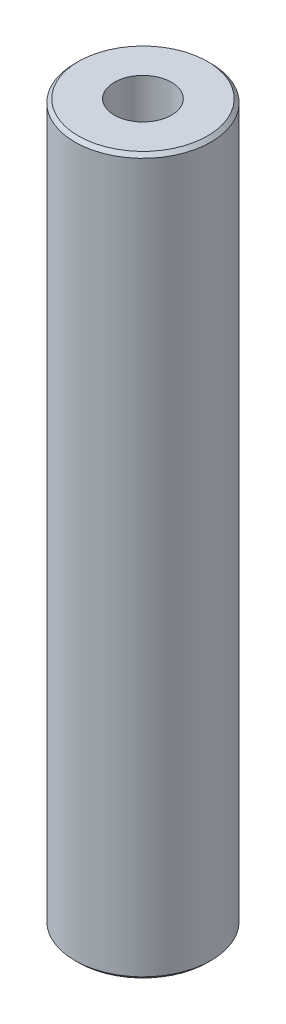
ISO-10303-21;
HEADER;
FILE_DESCRIPTION(('STEP AP214'),'2;1');
FILE_NAME('part.step','',(''),(''),'','','');
FILE_SCHEMA(('AUTOMOTIVE_DESIGN { 1 0 10303 214 1 1 1 1 }'));
ENDSEC;
DATA;
#1=APPLICATION_CONTEXT('core data for automotive mechanical design processes');
#2=APPLICATION_PROTOCOL_DEFINITION('international standard','automotive_design',2000,#1);
#3=PRODUCT_CONTEXT('',#1,'mechanical');
#4=PRODUCT('Part','Part','',(#3));
#5=PRODUCT_RELATED_PRODUCT_CATEGORY('part','',(#4));
#6=PRODUCT_DEFINITION_FORMATION('','',#4);
#7=PRODUCT_DEFINITION_CONTEXT('part definition',#1,'design');
#8=PRODUCT_DEFINITION('design','',#6,#7);
#9=PRODUCT_DEFINITION_SHAPE('','',#8);
#10=(LENGTH_UNIT() NAMED_UNIT(*) SI_UNIT(.MILLI.,.METRE.));
#11=(NAMED_UNIT(*) PLANE_ANGLE_UNIT() SI_UNIT($,.RADIAN.));
#12=(NAMED_UNIT(*) SI_UNIT($,.STERADIAN.) SOLID_ANGLE_UNIT());
#13=UNCERTAINTY_MEASURE_WITH_UNIT(LENGTH_MEASURE(1.E-05),#10,'distance_accuracy_value','');
#14=(GEOMETRIC_REPRESENTATION_CONTEXT(3) GLOBAL_UNCERTAINTY_ASSIGNED_CONTEXT((#13)) GLOBAL_UNIT_ASSIGNED_CONTEXT((#10,
#11,#12)) REPRESENTATION_CONTEXT('',''));
#15=CARTESIAN_POINT('',(0.,0.,0.));
#16=DIRECTION('',(0.,0.,1.));
#17=DIRECTION('',(1.,0.,0.));
#18=AXIS2_PLACEMENT_3D('',#15,#16,#17);
#19=CARTESIAN_POINT('',(0.,157.746344230071,0.));
#20=DIRECTION('',(0.,-1.,0.));
#21=DIRECTION('',(0.,0.,-1.));
#22=AXIS2_PLACEMENT_3D('',#19,#20,#21);
#23=CYLINDRICAL_SURFACE('',#22,15.);
#24=CARTESIAN_POINT('',(0.,156.971094666911,0.));
#25=DIRECTION('',(0.,1.,0.));
#26=DIRECTION('',(0.,0.,1.));
#27=AXIS2_PLACEMENT_3D('',#24,#25,#26);
#28=CIRCLE('',#27,15.);
#29=CARTESIAN_POINT('',(0.,156.971094666911,15.));
#30=VERTEX_POINT('',#29);
#31=EDGE_CURVE('E50',#30,#30,#28,.F.);
#32=ORIENTED_EDGE('',*,*,#31,.T.);
#33=EDGE_LOOP('',(#32));
#34=FACE_BOUND('',#33,.T.);
#35=CARTESIAN_POINT('',(0.,0.775249563159858,0.));
#36=DIRECTION('',(0.,1.,0.));
#37=DIRECTION('',(0.,0.,1.));
#38=AXIS2_PLACEMENT_3D('',#35,#36,#37);
#39=CIRCLE('',#38,15.);
#40=CARTESIAN_POINT('',(0.,0.775249563159858,15.));
#41=VERTEX_POINT('',#40);
#42=EDGE_CURVE('E51',#41,#41,#39,.T.);
#43=ORIENTED_EDGE('',*,*,#42,.T.);
#44=EDGE_LOOP('',(#43));
#45=FACE_BOUND('',#44,.T.);
#46=ADVANCED_FACE('F39',(#34,#45),#23,.T.);
#47=CARTESIAN_POINT('',(0.,157.746344230071,0.));
#48=DIRECTION('',(0.,1.,0.));
#49=DIRECTION('',(0.,0.,1.));
#50=AXIS2_PLACEMENT_3D('',#47,#48,#49);
#51=PLANE('',#50);
#52=CARTESIAN_POINT('',(0.,157.746344230071,0.));
#53=DIRECTION('',(0.,1.,0.));
#54=DIRECTION('',(0.,0.,1.));
#55=AXIS2_PLACEMENT_3D('',#52,#53,#54);
#56=CIRCLE('',#55,14.2247504368402);
#57=CARTESIAN_POINT('',(0.,157.746344230071,14.2247504368402));
#58=VERTEX_POINT('',#57);
#59=EDGE_CURVE('E54',#58,#58,#56,.T.);
#60=ORIENTED_EDGE('',*,*,#59,.T.);
#61=EDGE_LOOP('',(#60));
#62=FACE_BOUND('',#61,.T.);
#63=CARTESIAN_POINT('',(0.,157.746344230071,0.));
#64=DIRECTION('',(0.,1.,0.));
#65=DIRECTION('',(0.,0.,1.));
#66=AXIS2_PLACEMENT_3D('',#63,#64,#65);
#67=CIRCLE('',#66,6.29299490322832);
#68=CARTESIAN_POINT('',(0.,157.746344230071,6.29299490322832));
#69=VERTEX_POINT('',#68);
#70=EDGE_CURVE('E58',#69,#69,#67,.T.);
#71=ORIENTED_EDGE('',*,*,#70,.F.);
#72=EDGE_LOOP('',(#71));
#73=FACE_BOUND('',#72,.T.);
#74=ADVANCED_FACE('F69',(#62,#73),#51,.T.);
#75=CARTESIAN_POINT('',(0.,0.,0.));
#76=DIRECTION('',(0.,1.,0.));
#77=DIRECTION('',(0.,0.,1.));
#78=AXIS2_PLACEMENT_3D('',#75,#76,#77);
#79=PLANE('',#78);
#80=CARTESIAN_POINT('',(0.,0.,0.));
#81=DIRECTION('',(0.,1.,0.));
#82=DIRECTION('',(0.,0.,1.));
#83=AXIS2_PLACEMENT_3D('',#80,#81,#82);
#84=CIRCLE('',#83,14.2247504368401);
#85=CARTESIAN_POINT('',(0.,0.,14.2247504368401));
#86=VERTEX_POINT('',#85);
#87=EDGE_CURVE('E10',#86,#86,#84,.F.);
#88=ORIENTED_EDGE('',*,*,#87,.T.);
#89=EDGE_LOOP('',(#88));
#90=FACE_BOUND('',#89,.T.);
#91=CARTESIAN_POINT('',(0.,0.,0.));
#92=DIRECTION('',(0.,1.,0.));
#93=DIRECTION('',(0.,0.,1.));
#94=AXIS2_PLACEMENT_3D('',#91,#92,#93);
#95=CIRCLE('',#94,6.29299490322832);
#96=CARTESIAN_POINT('',(0.,0.,6.29299490322832));
#97=VERTEX_POINT('',#96);
#98=EDGE_CURVE('E63',#97,#97,#95,.T.);
#99=ORIENTED_EDGE('',*,*,#98,.T.);
#100=EDGE_LOOP('',(#99));
#101=FACE_BOUND('',#100,.T.);
#102=ADVANCED_FACE('F75',(#90,#101),#79,.F.);
#103=CARTESIAN_POINT('',(0.,157.746344230071,0.));
#104=DIRECTION('',(0.,-1.,0.));
#105=DIRECTION('',(0.,0.,-1.));
#106=AXIS2_PLACEMENT_3D('',#103,#104,#105);
#107=CYLINDRICAL_SURFACE('',#106,6.29299490322832);
#108=ORIENTED_EDGE('',*,*,#70,.T.);
#109=EDGE_LOOP('',(#108));
#110=FACE_BOUND('',#109,.T.);
#111=ORIENTED_EDGE('',*,*,#98,.F.);
#112=EDGE_LOOP('',(#111));
#113=FACE_BOUND('',#112,.T.);
#114=ADVANCED_FACE('F70',(#110,#113),#107,.F.);
#115=CARTESIAN_POINT('',(0.,157.746344230071,0.));
#116=DIRECTION('',(0.,-1.,0.));
#117=DIRECTION('',(0.,0.,-1.));
#118=AXIS2_PLACEMENT_3D('',#115,#116,#117);
#119=CONICAL_SURFACE('',#118,14.2247504368402,0.785398163397466);
#120=ORIENTED_EDGE('',*,*,#31,.F.);
#121=EDGE_LOOP('',(#120));
#122=FACE_BOUND('',#121,.T.);
#123=ORIENTED_EDGE('',*,*,#59,.F.);
#124=EDGE_LOOP('',(#123));
#125=FACE_BOUND('',#124,.T.);
#126=ADVANCED_FACE('F81',(#122,#125),#119,.T.);
#127=CARTESIAN_POINT('',(0.,0.775249563159858,0.));
#128=DIRECTION('',(0.,1.,0.));
#129=DIRECTION('',(0.,0.,1.));
#130=AXIS2_PLACEMENT_3D('',#127,#128,#129);
#131=CONICAL_SURFACE('',#130,15.,0.785398163397448);
#132=ORIENTED_EDGE('',*,*,#87,.F.);
#133=EDGE_LOOP('',(#132));
#134=FACE_BOUND('',#133,.T.);
#135=ORIENTED_EDGE('',*,*,#42,.F.);
#136=EDGE_LOOP('',(#135));
#137=FACE_BOUND('',#136,.T.);
#138=ADVANCED_FACE('F45',(#134,#137),#131,.T.);
#139=CLOSED_SHELL('',(#46,#74,#102,#114,#126,#138));
#140=MANIFOLD_SOLID_BREP('B2',#139);
#141=ADVANCED_BREP_SHAPE_REPRESENTATION('',(#18,#140),#14);
#142=SHAPE_DEFINITION_REPRESENTATION(#9,#141);
ENDSEC;
END-ISO-10303-21;
